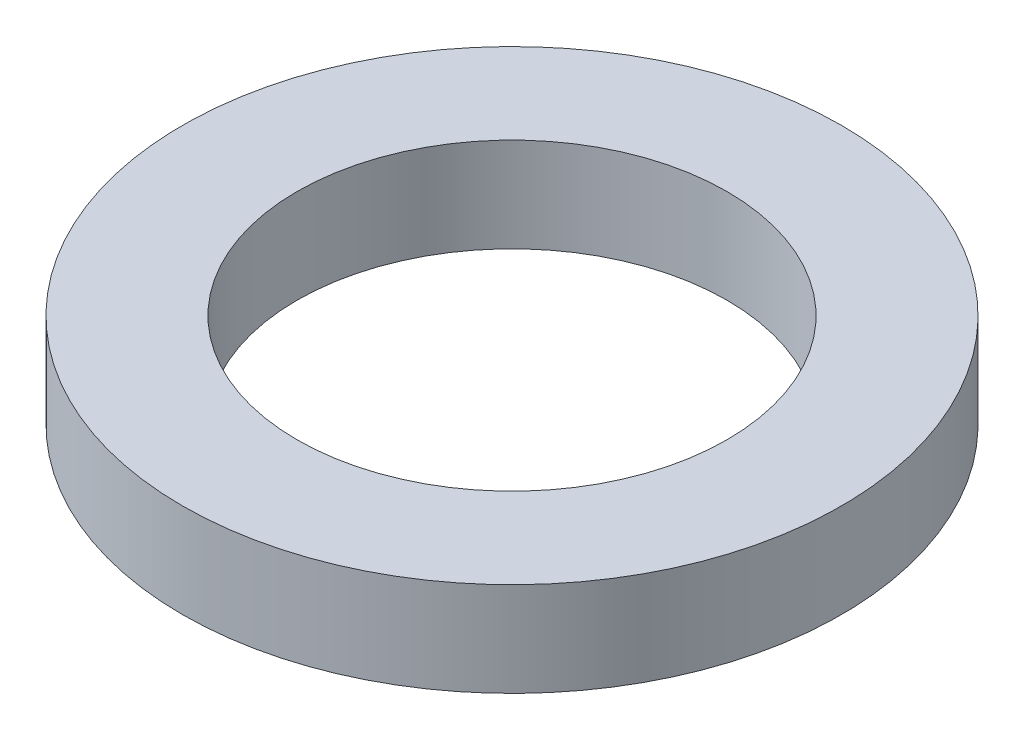
ISO-10303-21;
HEADER;
FILE_DESCRIPTION(('STEP AP214'),'2;1');
FILE_NAME('part.step','',(''),(''),'','','');
FILE_SCHEMA(('AUTOMOTIVE_DESIGN { 1 0 10303 214 1 1 1 1 }'));
ENDSEC;
DATA;
#1=APPLICATION_CONTEXT('core data for automotive mechanical design processes');
#2=APPLICATION_PROTOCOL_DEFINITION('international standard','automotive_design',2000,#1);
#3=PRODUCT_CONTEXT('',#1,'mechanical');
#4=PRODUCT('Part','Part','',(#3));
#5=PRODUCT_RELATED_PRODUCT_CATEGORY('part','',(#4));
#6=PRODUCT_DEFINITION_FORMATION('','',#4);
#7=PRODUCT_DEFINITION_CONTEXT('part definition',#1,'design');
#8=PRODUCT_DEFINITION('design','',#6,#7);
#9=PRODUCT_DEFINITION_SHAPE('','',#8);
#10=(LENGTH_UNIT() NAMED_UNIT(*) SI_UNIT(.MILLI.,.METRE.));
#11=(NAMED_UNIT(*) PLANE_ANGLE_UNIT() SI_UNIT($,.RADIAN.));
#12=(NAMED_UNIT(*) SI_UNIT($,.STERADIAN.) SOLID_ANGLE_UNIT());
#13=UNCERTAINTY_MEASURE_WITH_UNIT(LENGTH_MEASURE(1.E-05),#10,'distance_accuracy_value','');
#14=(GEOMETRIC_REPRESENTATION_CONTEXT(3) GLOBAL_UNCERTAINTY_ASSIGNED_CONTEXT((#13)) GLOBAL_UNIT_ASSIGNED_CONTEXT((#10,
#11,#12)) REPRESENTATION_CONTEXT('',''));
#15=CARTESIAN_POINT('',(0.,0.,0.));
#16=DIRECTION('',(0.,0.,1.));
#17=DIRECTION('',(1.,0.,0.));
#18=AXIS2_PLACEMENT_3D('',#15,#16,#17);
#19=CARTESIAN_POINT('',(0.,6.35,0.));
#20=DIRECTION('',(0.,1.,0.));
#21=DIRECTION('',(0.,0.,1.));
#22=AXIS2_PLACEMENT_3D('',#19,#20,#21);
#23=PLANE('',#22);
#24=CARTESIAN_POINT('',(0.,6.35,0.));
#25=DIRECTION('',(0.,1.,0.));
#26=DIRECTION('',(0.,0.,1.));
#27=AXIS2_PLACEMENT_3D('',#24,#25,#26);
#28=CIRCLE('',#27,22.225);
#29=CARTESIAN_POINT('',(0.,6.35,22.225));
#30=VERTEX_POINT('',#29);
#31=EDGE_CURVE('E10',#30,#30,#28,.T.);
#32=ORIENTED_EDGE('',*,*,#31,.T.);
#33=EDGE_LOOP('',(#32));
#34=FACE_BOUND('',#33,.T.);
#35=CARTESIAN_POINT('',(0.,6.35,0.));
#36=DIRECTION('',(0.,1.,0.));
#37=DIRECTION('',(0.,0.,1.));
#38=AXIS2_PLACEMENT_3D('',#35,#36,#37);
#39=CIRCLE('',#38,14.5);
#40=CARTESIAN_POINT('',(0.,6.35,14.5));
#41=VERTEX_POINT('',#40);
#42=EDGE_CURVE('E46',#41,#41,#39,.T.);
#43=ORIENTED_EDGE('',*,*,#42,.F.);
#44=EDGE_LOOP('',(#43));
#45=FACE_BOUND('',#44,.T.);
#46=ADVANCED_FACE('F35',(#34,#45),#23,.T.);
#47=CARTESIAN_POINT('',(0.,0.,0.));
#48=DIRECTION('',(0.,1.,0.));
#49=DIRECTION('',(0.,0.,1.));
#50=AXIS2_PLACEMENT_3D('',#47,#48,#49);
#51=PLANE('',#50);
#52=CARTESIAN_POINT('',(0.,0.,0.));
#53=DIRECTION('',(0.,1.,0.));
#54=DIRECTION('',(0.,0.,1.));
#55=AXIS2_PLACEMENT_3D('',#52,#53,#54);
#56=CIRCLE('',#55,22.225);
#57=CARTESIAN_POINT('',(0.,0.,22.225));
#58=VERTEX_POINT('',#57);
#59=EDGE_CURVE('E39',#58,#58,#56,.T.);
#60=ORIENTED_EDGE('',*,*,#59,.F.);
#61=EDGE_LOOP('',(#60));
#62=FACE_BOUND('',#61,.T.);
#63=CARTESIAN_POINT('',(0.,0.,0.));
#64=DIRECTION('',(0.,1.,0.));
#65=DIRECTION('',(0.,0.,1.));
#66=AXIS2_PLACEMENT_3D('',#63,#64,#65);
#67=CIRCLE('',#66,14.5);
#68=CARTESIAN_POINT('',(0.,0.,14.5));
#69=VERTEX_POINT('',#68);
#70=EDGE_CURVE('E48',#69,#69,#67,.T.);
#71=ORIENTED_EDGE('',*,*,#70,.T.);
#72=EDGE_LOOP('',(#71));
#73=FACE_BOUND('',#72,.T.);
#74=ADVANCED_FACE('F58',(#62,#73),#51,.F.);
#75=CARTESIAN_POINT('',(0.,6.35,0.));
#76=DIRECTION('',(0.,-1.,0.));
#77=DIRECTION('',(0.,0.,-1.));
#78=AXIS2_PLACEMENT_3D('',#75,#76,#77);
#79=CYLINDRICAL_SURFACE('',#78,22.225);
#80=ORIENTED_EDGE('',*,*,#31,.F.);
#81=EDGE_LOOP('',(#80));
#82=FACE_BOUND('',#81,.T.);
#83=ORIENTED_EDGE('',*,*,#59,.T.);
#84=EDGE_LOOP('',(#83));
#85=FACE_BOUND('',#84,.T.);
#86=ADVANCED_FACE('F37',(#82,#85),#79,.T.);
#87=CARTESIAN_POINT('',(0.,6.35,0.));
#88=DIRECTION('',(0.,-1.,0.));
#89=DIRECTION('',(0.,0.,-1.));
#90=AXIS2_PLACEMENT_3D('',#87,#88,#89);
#91=CYLINDRICAL_SURFACE('',#90,14.5);
#92=ORIENTED_EDGE('',*,*,#42,.T.);
#93=EDGE_LOOP('',(#92));
#94=FACE_BOUND('',#93,.T.);
#95=ORIENTED_EDGE('',*,*,#70,.F.);
#96=EDGE_LOOP('',(#95));
#97=FACE_BOUND('',#96,.T.);
#98=ADVANCED_FACE('F54',(#94,#97),#91,.F.);
#99=CLOSED_SHELL('',(#46,#74,#86,#98));
#100=MANIFOLD_SOLID_BREP('B2',#99);
#101=ADVANCED_BREP_SHAPE_REPRESENTATION('',(#18,#100),#14);
#102=SHAPE_DEFINITION_REPRESENTATION(#9,#101);
ENDSEC;
END-ISO-10303-21;
